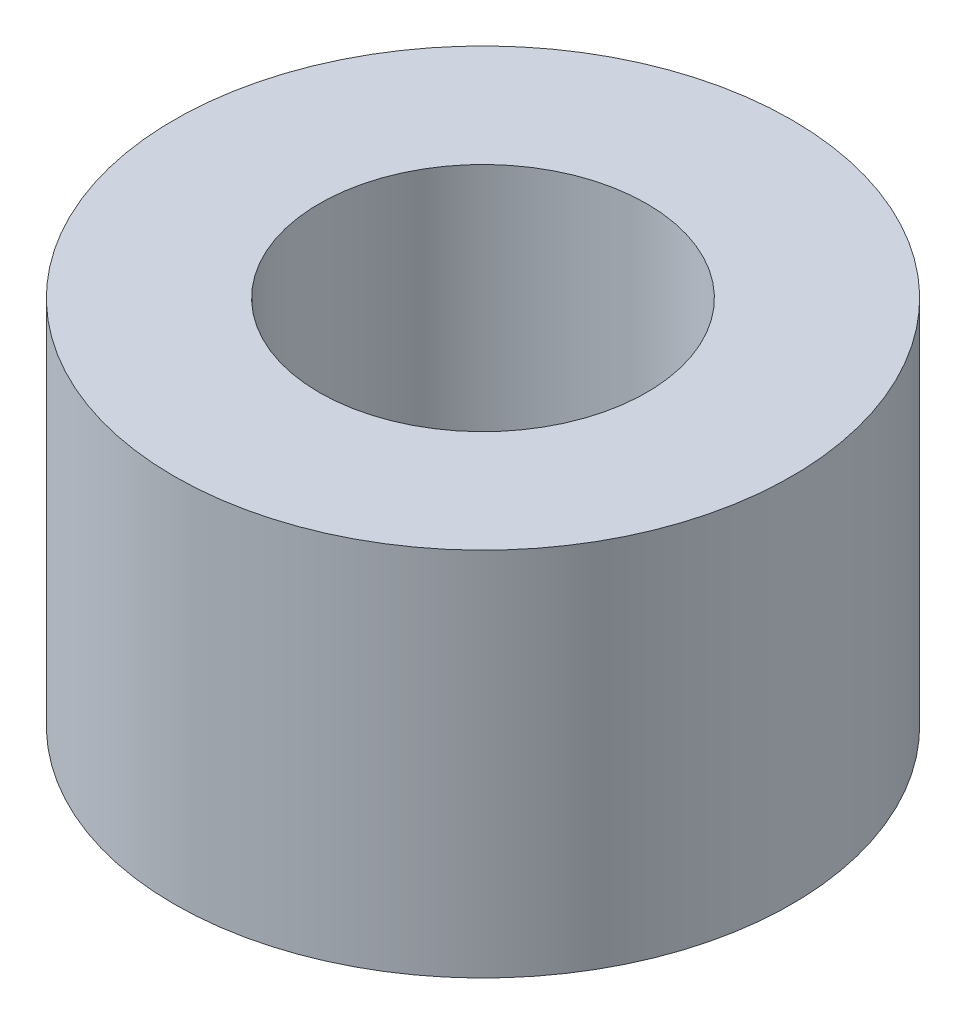
ISO-10303-21;
HEADER;
FILE_DESCRIPTION(('STEP AP214'),'2;1');
FILE_NAME('part.step','',(''),(''),'','','');
FILE_SCHEMA(('AUTOMOTIVE_DESIGN { 1 0 10303 214 1 1 1 1 }'));
ENDSEC;
DATA;
#1=APPLICATION_CONTEXT('core data for automotive mechanical design processes');
#2=APPLICATION_PROTOCOL_DEFINITION('international standard','automotive_design',2000,#1);
#3=PRODUCT_CONTEXT('',#1,'mechanical');
#4=PRODUCT('Part','Part','',(#3));
#5=PRODUCT_RELATED_PRODUCT_CATEGORY('part','',(#4));
#6=PRODUCT_DEFINITION_FORMATION('','',#4);
#7=PRODUCT_DEFINITION_CONTEXT('part definition',#1,'design');
#8=PRODUCT_DEFINITION('design','',#6,#7);
#9=PRODUCT_DEFINITION_SHAPE('','',#8);
#10=(LENGTH_UNIT() NAMED_UNIT(*) SI_UNIT(.MILLI.,.METRE.));
#11=(NAMED_UNIT(*) PLANE_ANGLE_UNIT() SI_UNIT($,.RADIAN.));
#12=(NAMED_UNIT(*) SI_UNIT($,.STERADIAN.) SOLID_ANGLE_UNIT());
#13=UNCERTAINTY_MEASURE_WITH_UNIT(LENGTH_MEASURE(1.E-05),#10,'distance_accuracy_value','');
#14=(GEOMETRIC_REPRESENTATION_CONTEXT(3) GLOBAL_UNCERTAINTY_ASSIGNED_CONTEXT((#13)) GLOBAL_UNIT_ASSIGNED_CONTEXT((#10,
#11,#12)) REPRESENTATION_CONTEXT('',''));
#15=CARTESIAN_POINT('',(0.,0.,0.));
#16=DIRECTION('',(0.,0.,1.));
#17=DIRECTION('',(1.,0.,0.));
#18=AXIS2_PLACEMENT_3D('',#15,#16,#17);
#19=CARTESIAN_POINT('',(0.,6.,0.));
#20=DIRECTION('',(0.,1.,0.));
#21=DIRECTION('',(0.,0.,1.));
#22=AXIS2_PLACEMENT_3D('',#19,#20,#21);
#23=PLANE('',#22);
#24=CARTESIAN_POINT('',(0.,6.,0.));
#25=DIRECTION('',(0.,1.,0.));
#26=DIRECTION('',(0.,0.,1.));
#27=AXIS2_PLACEMENT_3D('',#24,#25,#26);
#28=CIRCLE('',#27,5.);
#29=CARTESIAN_POINT('',(0.,6.,5.));
#30=VERTEX_POINT('',#29);
#31=EDGE_CURVE('E10',#30,#30,#28,.T.);
#32=ORIENTED_EDGE('',*,*,#31,.T.);
#33=EDGE_LOOP('',(#32));
#34=FACE_BOUND('',#33,.T.);
#35=CARTESIAN_POINT('',(0.,6.,0.));
#36=DIRECTION('',(0.,1.,0.));
#37=DIRECTION('',(0.,0.,1.));
#38=AXIS2_PLACEMENT_3D('',#35,#36,#37);
#39=CIRCLE('',#38,2.65);
#40=CARTESIAN_POINT('',(0.,6.,2.65));
#41=VERTEX_POINT('',#40);
#42=EDGE_CURVE('E42',#41,#41,#39,.T.);
#43=ORIENTED_EDGE('',*,*,#42,.F.);
#44=EDGE_LOOP('',(#43));
#45=FACE_BOUND('',#44,.T.);
#46=ADVANCED_FACE('F31',(#34,#45),#23,.T.);
#47=CARTESIAN_POINT('',(0.,0.,0.));
#48=DIRECTION('',(0.,1.,0.));
#49=DIRECTION('',(0.,0.,1.));
#50=AXIS2_PLACEMENT_3D('',#47,#48,#49);
#51=PLANE('',#50);
#52=CARTESIAN_POINT('',(0.,0.,0.));
#53=DIRECTION('',(0.,1.,0.));
#54=DIRECTION('',(0.,0.,1.));
#55=AXIS2_PLACEMENT_3D('',#52,#53,#54);
#56=CIRCLE('',#55,5.);
#57=CARTESIAN_POINT('',(0.,0.,5.));
#58=VERTEX_POINT('',#57);
#59=EDGE_CURVE('E35',#58,#58,#56,.T.);
#60=ORIENTED_EDGE('',*,*,#59,.F.);
#61=EDGE_LOOP('',(#60));
#62=FACE_BOUND('',#61,.T.);
#63=CARTESIAN_POINT('',(0.,0.,0.));
#64=DIRECTION('',(0.,1.,0.));
#65=DIRECTION('',(0.,0.,1.));
#66=AXIS2_PLACEMENT_3D('',#63,#64,#65);
#67=CIRCLE('',#66,2.65);
#68=CARTESIAN_POINT('',(0.,0.,2.65));
#69=VERTEX_POINT('',#68);
#70=EDGE_CURVE('E44',#69,#69,#67,.T.);
#71=ORIENTED_EDGE('',*,*,#70,.T.);
#72=EDGE_LOOP('',(#71));
#73=FACE_BOUND('',#72,.T.);
#74=ADVANCED_FACE('F54',(#62,#73),#51,.F.);
#75=CARTESIAN_POINT('',(0.,6.,0.));
#76=DIRECTION('',(0.,-1.,0.));
#77=DIRECTION('',(0.,0.,-1.));
#78=AXIS2_PLACEMENT_3D('',#75,#76,#77);
#79=CYLINDRICAL_SURFACE('',#78,5.);
#80=ORIENTED_EDGE('',*,*,#31,.F.);
#81=EDGE_LOOP('',(#80));
#82=FACE_BOUND('',#81,.T.);
#83=ORIENTED_EDGE('',*,*,#59,.T.);
#84=EDGE_LOOP('',(#83));
#85=FACE_BOUND('',#84,.T.);
#86=ADVANCED_FACE('F33',(#82,#85),#79,.T.);
#87=CARTESIAN_POINT('',(0.,6.,0.));
#88=DIRECTION('',(0.,-1.,0.));
#89=DIRECTION('',(0.,0.,-1.));
#90=AXIS2_PLACEMENT_3D('',#87,#88,#89);
#91=CYLINDRICAL_SURFACE('',#90,2.65);
#92=ORIENTED_EDGE('',*,*,#42,.T.);
#93=EDGE_LOOP('',(#92));
#94=FACE_BOUND('',#93,.T.);
#95=ORIENTED_EDGE('',*,*,#70,.F.);
#96=EDGE_LOOP('',(#95));
#97=FACE_BOUND('',#96,.T.);
#98=ADVANCED_FACE('F50',(#94,#97),#91,.F.);
#99=CLOSED_SHELL('',(#46,#74,#86,#98));
#100=MANIFOLD_SOLID_BREP('B2',#99);
#101=ADVANCED_BREP_SHAPE_REPRESENTATION('',(#18,#100),#14);
#102=SHAPE_DEFINITION_REPRESENTATION(#9,#101);
ENDSEC;
END-ISO-10303-21;
